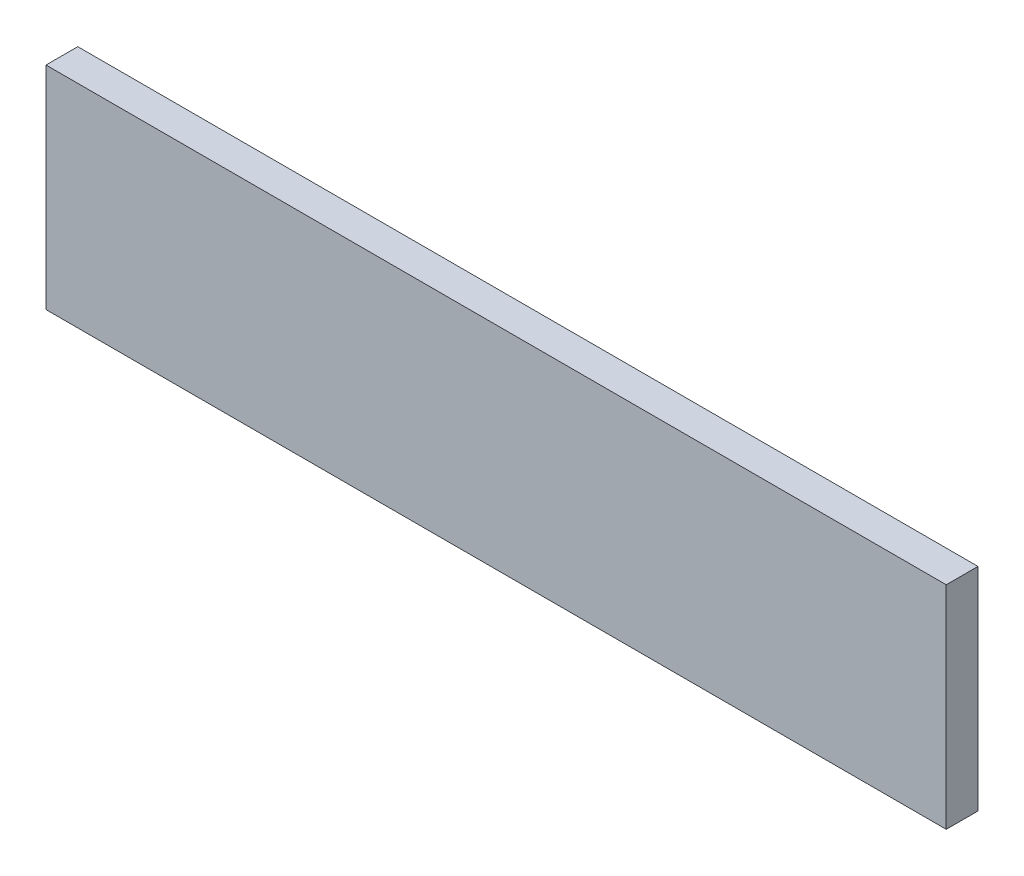
ISO-10303-21;
HEADER;
FILE_DESCRIPTION(('STEP AP214'),'2;1');
FILE_NAME('part.step','',(''),(''),'','','');
FILE_SCHEMA(('AUTOMOTIVE_DESIGN { 1 0 10303 214 1 1 1 1 }'));
ENDSEC;
DATA;
#1=APPLICATION_CONTEXT('core data for automotive mechanical design processes');
#2=APPLICATION_PROTOCOL_DEFINITION('international standard','automotive_design',2000,#1);
#3=PRODUCT_CONTEXT('',#1,'mechanical');
#4=PRODUCT('Part','Part','',(#3));
#5=PRODUCT_RELATED_PRODUCT_CATEGORY('part','',(#4));
#6=PRODUCT_DEFINITION_FORMATION('','',#4);
#7=PRODUCT_DEFINITION_CONTEXT('part definition',#1,'design');
#8=PRODUCT_DEFINITION('design','',#6,#7);
#9=PRODUCT_DEFINITION_SHAPE('','',#8);
#10=(LENGTH_UNIT() NAMED_UNIT(*) SI_UNIT(.MILLI.,.METRE.));
#11=(NAMED_UNIT(*) PLANE_ANGLE_UNIT() SI_UNIT($,.RADIAN.));
#12=(NAMED_UNIT(*) SI_UNIT($,.STERADIAN.) SOLID_ANGLE_UNIT());
#13=UNCERTAINTY_MEASURE_WITH_UNIT(LENGTH_MEASURE(1.E-05),#10,'distance_accuracy_value','');
#14=(GEOMETRIC_REPRESENTATION_CONTEXT(3) GLOBAL_UNCERTAINTY_ASSIGNED_CONTEXT((#13)) GLOBAL_UNIT_ASSIGNED_CONTEXT((#10,
#11,#12)) REPRESENTATION_CONTEXT('',''));
#15=CARTESIAN_POINT('',(0.,0.,0.));
#16=DIRECTION('',(0.,0.,1.));
#17=DIRECTION('',(1.,0.,0.));
#18=AXIS2_PLACEMENT_3D('',#15,#16,#17);
#19=CARTESIAN_POINT('',(0.,0.,6.));
#20=DIRECTION('',(1.,0.,0.));
#21=DIRECTION('',(0.,0.,-1.));
#22=AXIS2_PLACEMENT_3D('',#19,#20,#21);
#23=PLANE('',#22);
#24=DIRECTION('',(0.,-1.,0.));
#25=VECTOR('',#24,1.);
#26=CARTESIAN_POINT('',(0.,0.,0.));
#27=LINE('',#26,#25);
#28=CARTESIAN_POINT('',(0.,40.,0.));
#29=VERTEX_POINT('',#28);
#30=CARTESIAN_POINT('',(0.,0.,0.));
#31=VERTEX_POINT('',#30);
#32=EDGE_CURVE('E97',#29,#31,#27,.T.);
#33=ORIENTED_EDGE('',*,*,#32,.T.);
#34=DIRECTION('',(0.,0.,-1.));
#35=VECTOR('',#34,1.);
#36=CARTESIAN_POINT('',(0.,0.,6.));
#37=LINE('',#36,#35);
#38=CARTESIAN_POINT('',(0.,0.,6.));
#39=VERTEX_POINT('',#38);
#40=EDGE_CURVE('E11',#39,#31,#37,.T.);
#41=ORIENTED_EDGE('',*,*,#40,.F.);
#42=DIRECTION('',(0.,-1.,0.));
#43=VECTOR('',#42,1.);
#44=CARTESIAN_POINT('',(0.,0.,6.));
#45=LINE('',#44,#43);
#46=CARTESIAN_POINT('',(0.,40.,6.));
#47=VERTEX_POINT('',#46);
#48=EDGE_CURVE('E85',#47,#39,#45,.T.);
#49=ORIENTED_EDGE('',*,*,#48,.F.);
#50=DIRECTION('',(0.,0.,-1.));
#51=VECTOR('',#50,1.);
#52=CARTESIAN_POINT('',(0.,40.,6.));
#53=LINE('',#52,#51);
#54=EDGE_CURVE('E93',#47,#29,#53,.T.);
#55=ORIENTED_EDGE('',*,*,#54,.T.);
#56=EDGE_LOOP('',(#33,#41,#49,#55));
#57=FACE_BOUND('',#56,.T.);
#58=ADVANCED_FACE('F34',(#57),#23,.F.);
#59=CARTESIAN_POINT('',(0.,0.,6.));
#60=DIRECTION('',(0.,1.,0.));
#61=DIRECTION('',(0.,0.,1.));
#62=AXIS2_PLACEMENT_3D('',#59,#60,#61);
#63=PLANE('',#62);
#64=DIRECTION('',(1.,0.,0.));
#65=VECTOR('',#64,1.);
#66=CARTESIAN_POINT('',(0.,0.,0.));
#67=LINE('',#66,#65);
#68=CARTESIAN_POINT('',(170.,0.,0.));
#69=VERTEX_POINT('',#68);
#70=EDGE_CURVE('E89',#31,#69,#67,.T.);
#71=ORIENTED_EDGE('',*,*,#70,.T.);
#72=DIRECTION('',(0.,0.,-1.));
#73=VECTOR('',#72,1.);
#74=CARTESIAN_POINT('',(170.,0.,6.));
#75=LINE('',#74,#73);
#76=CARTESIAN_POINT('',(170.,0.,6.));
#77=VERTEX_POINT('',#76);
#78=EDGE_CURVE('E42',#77,#69,#75,.T.);
#79=ORIENTED_EDGE('',*,*,#78,.F.);
#80=DIRECTION('',(1.,0.,0.));
#81=VECTOR('',#80,1.);
#82=CARTESIAN_POINT('',(0.,0.,6.));
#83=LINE('',#82,#81);
#84=EDGE_CURVE('E80',#39,#77,#83,.T.);
#85=ORIENTED_EDGE('',*,*,#84,.F.);
#86=ORIENTED_EDGE('',*,*,#40,.T.);
#87=EDGE_LOOP('',(#71,#79,#85,#86));
#88=FACE_BOUND('',#87,.T.);
#89=ADVANCED_FACE('F88',(#88),#63,.F.);
#90=CARTESIAN_POINT('',(170.,0.,6.));
#91=DIRECTION('',(-1.,0.,0.));
#92=DIRECTION('',(0.,0.,1.));
#93=AXIS2_PLACEMENT_3D('',#90,#91,#92);
#94=PLANE('',#93);
#95=DIRECTION('',(0.,1.,0.));
#96=VECTOR('',#95,1.);
#97=CARTESIAN_POINT('',(170.,0.,0.));
#98=LINE('',#97,#96);
#99=CARTESIAN_POINT('',(170.,40.,0.));
#100=VERTEX_POINT('',#99);
#101=EDGE_CURVE('E67',#69,#100,#98,.T.);
#102=ORIENTED_EDGE('',*,*,#101,.T.);
#103=DIRECTION('',(0.,0.,-1.));
#104=VECTOR('',#103,1.);
#105=CARTESIAN_POINT('',(170.,40.,6.));
#106=LINE('',#105,#104);
#107=CARTESIAN_POINT('',(170.,40.,6.));
#108=VERTEX_POINT('',#107);
#109=EDGE_CURVE('E90',#108,#100,#106,.T.);
#110=ORIENTED_EDGE('',*,*,#109,.F.);
#111=DIRECTION('',(0.,1.,0.));
#112=VECTOR('',#111,1.);
#113=CARTESIAN_POINT('',(170.,0.,6.));
#114=LINE('',#113,#112);
#115=EDGE_CURVE('E83',#77,#108,#114,.T.);
#116=ORIENTED_EDGE('',*,*,#115,.F.);
#117=ORIENTED_EDGE('',*,*,#78,.T.);
#118=EDGE_LOOP('',(#102,#110,#116,#117));
#119=FACE_BOUND('',#118,.T.);
#120=ADVANCED_FACE('F91',(#119),#94,.F.);
#121=CARTESIAN_POINT('',(0.,40.,6.));
#122=DIRECTION('',(0.,-1.,0.));
#123=DIRECTION('',(0.,0.,-1.));
#124=AXIS2_PLACEMENT_3D('',#121,#122,#123);
#125=PLANE('',#124);
#126=DIRECTION('',(-1.,0.,0.));
#127=VECTOR('',#126,1.);
#128=CARTESIAN_POINT('',(0.,40.,0.));
#129=LINE('',#128,#127);
#130=EDGE_CURVE('E73',#100,#29,#129,.T.);
#131=ORIENTED_EDGE('',*,*,#130,.T.);
#132=ORIENTED_EDGE('',*,*,#54,.F.);
#133=DIRECTION('',(-1.,0.,0.));
#134=VECTOR('',#133,1.);
#135=CARTESIAN_POINT('',(0.,40.,6.));
#136=LINE('',#135,#134);
#137=EDGE_CURVE('E50',#108,#47,#136,.T.);
#138=ORIENTED_EDGE('',*,*,#137,.F.);
#139=ORIENTED_EDGE('',*,*,#109,.T.);
#140=EDGE_LOOP('',(#131,#132,#138,#139));
#141=FACE_BOUND('',#140,.T.);
#142=ADVANCED_FACE('F104',(#141),#125,.F.);
#143=CARTESIAN_POINT('',(0.,40.,6.));
#144=DIRECTION('',(0.,0.,-1.));
#145=DIRECTION('',(-1.,0.,0.));
#146=AXIS2_PLACEMENT_3D('',#143,#144,#145);
#147=PLANE('',#146);
#148=ORIENTED_EDGE('',*,*,#48,.T.);
#149=ORIENTED_EDGE('',*,*,#84,.T.);
#150=ORIENTED_EDGE('',*,*,#115,.T.);
#151=ORIENTED_EDGE('',*,*,#137,.T.);
#152=EDGE_LOOP('',(#148,#149,#150,#151));
#153=FACE_BOUND('',#152,.T.);
#154=ADVANCED_FACE('F81',(#153),#147,.F.);
#155=CARTESIAN_POINT('',(0.,40.,0.));
#156=DIRECTION('',(0.,0.,-1.));
#157=DIRECTION('',(-1.,0.,0.));
#158=AXIS2_PLACEMENT_3D('',#155,#156,#157);
#159=PLANE('',#158);
#160=ORIENTED_EDGE('',*,*,#32,.F.);
#161=ORIENTED_EDGE('',*,*,#130,.F.);
#162=ORIENTED_EDGE('',*,*,#101,.F.);
#163=ORIENTED_EDGE('',*,*,#70,.F.);
#164=EDGE_LOOP('',(#160,#161,#162,#163));
#165=FACE_BOUND('',#164,.T.);
#166=ADVANCED_FACE('F107',(#165),#159,.T.);
#167=CLOSED_SHELL('',(#58,#89,#120,#142,#154,#166));
#168=MANIFOLD_SOLID_BREP('B2',#167);
#169=ADVANCED_BREP_SHAPE_REPRESENTATION('',(#18,#168),#14);
#170=SHAPE_DEFINITION_REPRESENTATION(#9,#169);
ENDSEC;
END-ISO-10303-21;
